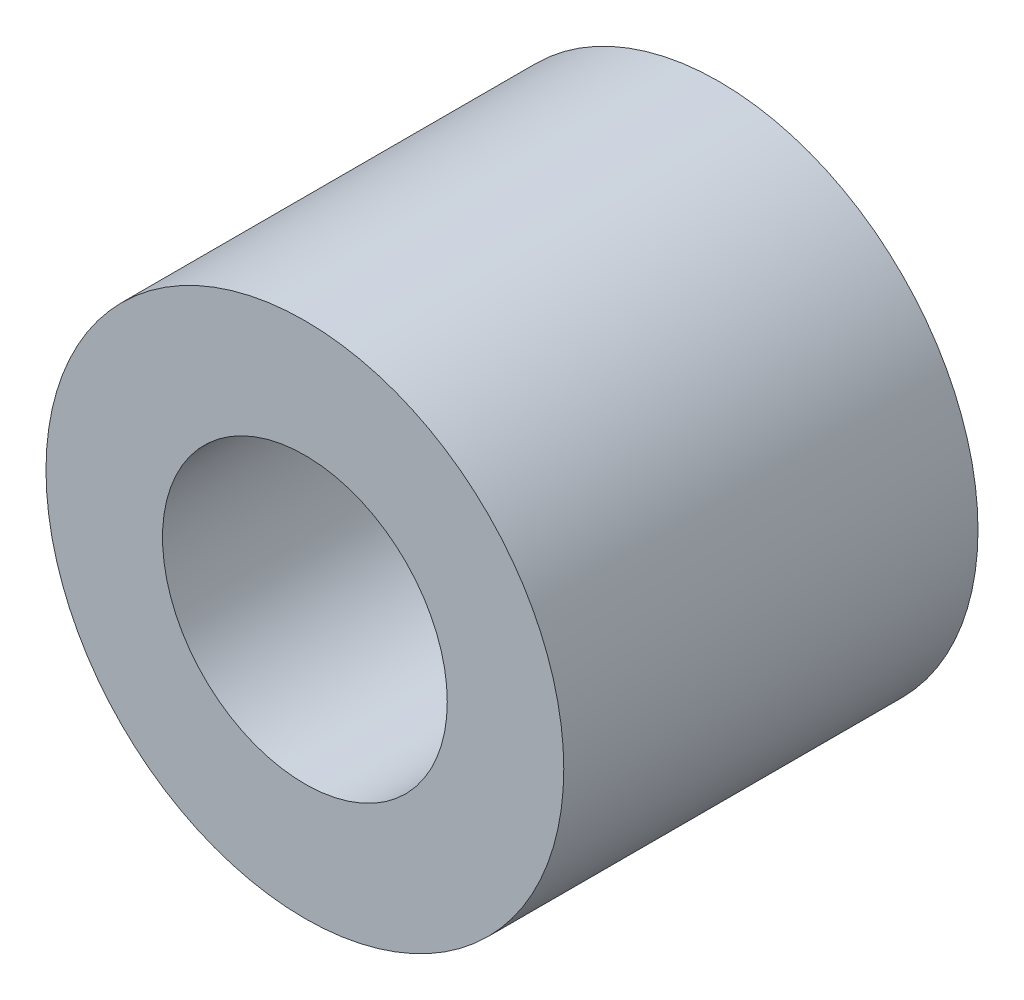
ISO-10303-21;
HEADER;
FILE_DESCRIPTION(('STEP AP214'),'2;1');
FILE_NAME('part.step','',(''),(''),'','','');
FILE_SCHEMA(('AUTOMOTIVE_DESIGN { 1 0 10303 214 1 1 1 1 }'));
ENDSEC;
DATA;
#1=APPLICATION_CONTEXT('core data for automotive mechanical design processes');
#2=APPLICATION_PROTOCOL_DEFINITION('international standard','automotive_design',2000,#1);
#3=PRODUCT_CONTEXT('',#1,'mechanical');
#4=PRODUCT('Part','Part','',(#3));
#5=PRODUCT_RELATED_PRODUCT_CATEGORY('part','',(#4));
#6=PRODUCT_DEFINITION_FORMATION('','',#4);
#7=PRODUCT_DEFINITION_CONTEXT('part definition',#1,'design');
#8=PRODUCT_DEFINITION('design','',#6,#7);
#9=PRODUCT_DEFINITION_SHAPE('','',#8);
#10=(LENGTH_UNIT() NAMED_UNIT(*) SI_UNIT(.MILLI.,.METRE.));
#11=(NAMED_UNIT(*) PLANE_ANGLE_UNIT() SI_UNIT($,.RADIAN.));
#12=(NAMED_UNIT(*) SI_UNIT($,.STERADIAN.) SOLID_ANGLE_UNIT());
#13=UNCERTAINTY_MEASURE_WITH_UNIT(LENGTH_MEASURE(1.E-05),#10,'distance_accuracy_value','');
#14=(GEOMETRIC_REPRESENTATION_CONTEXT(3) GLOBAL_UNCERTAINTY_ASSIGNED_CONTEXT((#13)) GLOBAL_UNIT_ASSIGNED_CONTEXT((#10,
#11,#12)) REPRESENTATION_CONTEXT('',''));
#15=CARTESIAN_POINT('',(0.,0.,0.));
#16=DIRECTION('',(0.,0.,1.));
#17=DIRECTION('',(1.,0.,0.));
#18=AXIS2_PLACEMENT_3D('',#15,#16,#17);
#19=CARTESIAN_POINT('',(0.,0.,4.));
#20=DIRECTION('',(0.,0.,1.));
#21=DIRECTION('',(1.,0.,0.));
#22=AXIS2_PLACEMENT_3D('',#19,#20,#21);
#23=PLANE('',#22);
#24=CARTESIAN_POINT('',(0.,0.,4.));
#25=DIRECTION('',(0.,0.,1.));
#26=DIRECTION('',(1.,0.,0.));
#27=AXIS2_PLACEMENT_3D('',#24,#25,#26);
#28=CIRCLE('',#27,2.5);
#29=CARTESIAN_POINT('',(2.5,0.,4.));
#30=VERTEX_POINT('',#29);
#31=EDGE_CURVE('E10',#30,#30,#28,.T.);
#32=ORIENTED_EDGE('',*,*,#31,.T.);
#33=EDGE_LOOP('',(#32));
#34=FACE_BOUND('',#33,.T.);
#35=CARTESIAN_POINT('',(0.,0.,4.));
#36=DIRECTION('',(0.,0.,1.));
#37=DIRECTION('',(1.,0.,0.));
#38=AXIS2_PLACEMENT_3D('',#35,#36,#37);
#39=CIRCLE('',#38,1.375);
#40=CARTESIAN_POINT('',(1.375,0.,4.));
#41=VERTEX_POINT('',#40);
#42=EDGE_CURVE('E42',#41,#41,#39,.T.);
#43=ORIENTED_EDGE('',*,*,#42,.F.);
#44=EDGE_LOOP('',(#43));
#45=FACE_BOUND('',#44,.T.);
#46=ADVANCED_FACE('F31',(#34,#45),#23,.T.);
#47=CARTESIAN_POINT('',(0.,0.,0.));
#48=DIRECTION('',(0.,0.,1.));
#49=DIRECTION('',(1.,0.,0.));
#50=AXIS2_PLACEMENT_3D('',#47,#48,#49);
#51=PLANE('',#50);
#52=CARTESIAN_POINT('',(0.,0.,0.));
#53=DIRECTION('',(0.,0.,1.));
#54=DIRECTION('',(1.,0.,0.));
#55=AXIS2_PLACEMENT_3D('',#52,#53,#54);
#56=CIRCLE('',#55,2.5);
#57=CARTESIAN_POINT('',(2.5,0.,0.));
#58=VERTEX_POINT('',#57);
#59=EDGE_CURVE('E35',#58,#58,#56,.T.);
#60=ORIENTED_EDGE('',*,*,#59,.F.);
#61=EDGE_LOOP('',(#60));
#62=FACE_BOUND('',#61,.T.);
#63=CARTESIAN_POINT('',(0.,0.,0.));
#64=DIRECTION('',(0.,0.,1.));
#65=DIRECTION('',(1.,0.,0.));
#66=AXIS2_PLACEMENT_3D('',#63,#64,#65);
#67=CIRCLE('',#66,1.375);
#68=CARTESIAN_POINT('',(1.375,0.,0.));
#69=VERTEX_POINT('',#68);
#70=EDGE_CURVE('E44',#69,#69,#67,.T.);
#71=ORIENTED_EDGE('',*,*,#70,.T.);
#72=EDGE_LOOP('',(#71));
#73=FACE_BOUND('',#72,.T.);
#74=ADVANCED_FACE('F54',(#62,#73),#51,.F.);
#75=CARTESIAN_POINT('',(0.,0.,4.));
#76=DIRECTION('',(0.,0.,-1.));
#77=DIRECTION('',(-1.,0.,0.));
#78=AXIS2_PLACEMENT_3D('',#75,#76,#77);
#79=CYLINDRICAL_SURFACE('',#78,2.5);
#80=ORIENTED_EDGE('',*,*,#31,.F.);
#81=EDGE_LOOP('',(#80));
#82=FACE_BOUND('',#81,.T.);
#83=ORIENTED_EDGE('',*,*,#59,.T.);
#84=EDGE_LOOP('',(#83));
#85=FACE_BOUND('',#84,.T.);
#86=ADVANCED_FACE('F33',(#82,#85),#79,.T.);
#87=CARTESIAN_POINT('',(0.,0.,4.));
#88=DIRECTION('',(0.,0.,-1.));
#89=DIRECTION('',(-1.,0.,0.));
#90=AXIS2_PLACEMENT_3D('',#87,#88,#89);
#91=CYLINDRICAL_SURFACE('',#90,1.375);
#92=ORIENTED_EDGE('',*,*,#42,.T.);
#93=EDGE_LOOP('',(#92));
#94=FACE_BOUND('',#93,.T.);
#95=ORIENTED_EDGE('',*,*,#70,.F.);
#96=EDGE_LOOP('',(#95));
#97=FACE_BOUND('',#96,.T.);
#98=ADVANCED_FACE('F50',(#94,#97),#91,.F.);
#99=CLOSED_SHELL('',(#46,#74,#86,#98));
#100=MANIFOLD_SOLID_BREP('B2',#99);
#101=ADVANCED_BREP_SHAPE_REPRESENTATION('',(#18,#100),#14);
#102=SHAPE_DEFINITION_REPRESENTATION(#9,#101);
ENDSEC;
END-ISO-10303-21;
